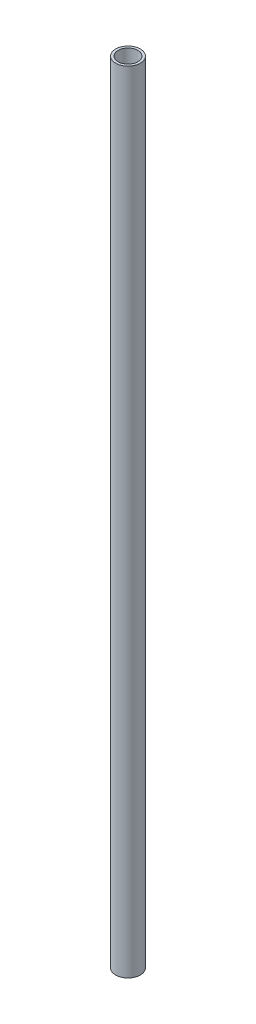
ISO-10303-21;
HEADER;
FILE_DESCRIPTION(('STEP AP214'),'2;1');
FILE_NAME('part.step','',(''),(''),'','','');
FILE_SCHEMA(('AUTOMOTIVE_DESIGN { 1 0 10303 214 1 1 1 1 }'));
ENDSEC;
DATA;
#1=APPLICATION_CONTEXT('core data for automotive mechanical design processes');
#2=APPLICATION_PROTOCOL_DEFINITION('international standard','automotive_design',2000,#1);
#3=PRODUCT_CONTEXT('',#1,'mechanical');
#4=PRODUCT('Part','Part','',(#3));
#5=PRODUCT_RELATED_PRODUCT_CATEGORY('part','',(#4));
#6=PRODUCT_DEFINITION_FORMATION('','',#4);
#7=PRODUCT_DEFINITION_CONTEXT('part definition',#1,'design');
#8=PRODUCT_DEFINITION('design','',#6,#7);
#9=PRODUCT_DEFINITION_SHAPE('','',#8);
#10=(LENGTH_UNIT() NAMED_UNIT(*) SI_UNIT(.MILLI.,.METRE.));
#11=(NAMED_UNIT(*) PLANE_ANGLE_UNIT() SI_UNIT($,.RADIAN.));
#12=(NAMED_UNIT(*) SI_UNIT($,.STERADIAN.) SOLID_ANGLE_UNIT());
#13=UNCERTAINTY_MEASURE_WITH_UNIT(LENGTH_MEASURE(1.E-05),#10,'distance_accuracy_value','');
#14=(GEOMETRIC_REPRESENTATION_CONTEXT(3) GLOBAL_UNCERTAINTY_ASSIGNED_CONTEXT((#13)) GLOBAL_UNIT_ASSIGNED_CONTEXT((#10,
#11,#12)) REPRESENTATION_CONTEXT('',''));
#15=CARTESIAN_POINT('',(0.,0.,0.));
#16=DIRECTION('',(0.,0.,1.));
#17=DIRECTION('',(1.,0.,0.));
#18=AXIS2_PLACEMENT_3D('',#15,#16,#17);
#19=CARTESIAN_POINT('',(0.,304.8,0.));
#20=DIRECTION('',(0.,1.,0.));
#21=DIRECTION('',(0.,0.,1.));
#22=AXIS2_PLACEMENT_3D('',#19,#20,#21);
#23=PLANE('',#22);
#24=CARTESIAN_POINT('',(0.,304.8,0.));
#25=DIRECTION('',(0.,1.,0.));
#26=DIRECTION('',(0.,0.,1.));
#27=AXIS2_PLACEMENT_3D('',#24,#25,#26);
#28=CIRCLE('',#27,4.7625);
#29=CARTESIAN_POINT('',(0.,304.8,4.7625));
#30=VERTEX_POINT('',#29);
#31=EDGE_CURVE('E10',#30,#30,#28,.T.);
#32=ORIENTED_EDGE('',*,*,#31,.T.);
#33=EDGE_LOOP('',(#32));
#34=FACE_BOUND('',#33,.T.);
#35=CARTESIAN_POINT('',(0.,304.8,0.));
#36=DIRECTION('',(0.,1.,0.));
#37=DIRECTION('',(0.,0.,1.));
#38=AXIS2_PLACEMENT_3D('',#35,#36,#37);
#39=CIRCLE('',#38,3.81);
#40=CARTESIAN_POINT('',(0.,304.8,3.81));
#41=VERTEX_POINT('',#40);
#42=EDGE_CURVE('E42',#41,#41,#39,.T.);
#43=ORIENTED_EDGE('',*,*,#42,.F.);
#44=EDGE_LOOP('',(#43));
#45=FACE_BOUND('',#44,.T.);
#46=ADVANCED_FACE('F31',(#34,#45),#23,.T.);
#47=CARTESIAN_POINT('',(0.,0.,0.));
#48=DIRECTION('',(0.,1.,0.));
#49=DIRECTION('',(0.,0.,1.));
#50=AXIS2_PLACEMENT_3D('',#47,#48,#49);
#51=PLANE('',#50);
#52=CARTESIAN_POINT('',(0.,0.,0.));
#53=DIRECTION('',(0.,1.,0.));
#54=DIRECTION('',(0.,0.,1.));
#55=AXIS2_PLACEMENT_3D('',#52,#53,#54);
#56=CIRCLE('',#55,4.7625);
#57=CARTESIAN_POINT('',(0.,0.,4.7625));
#58=VERTEX_POINT('',#57);
#59=EDGE_CURVE('E35',#58,#58,#56,.T.);
#60=ORIENTED_EDGE('',*,*,#59,.F.);
#61=EDGE_LOOP('',(#60));
#62=FACE_BOUND('',#61,.T.);
#63=CARTESIAN_POINT('',(0.,0.,0.));
#64=DIRECTION('',(0.,1.,0.));
#65=DIRECTION('',(0.,0.,1.));
#66=AXIS2_PLACEMENT_3D('',#63,#64,#65);
#67=CIRCLE('',#66,3.81);
#68=CARTESIAN_POINT('',(0.,0.,3.81));
#69=VERTEX_POINT('',#68);
#70=EDGE_CURVE('E44',#69,#69,#67,.T.);
#71=ORIENTED_EDGE('',*,*,#70,.T.);
#72=EDGE_LOOP('',(#71));
#73=FACE_BOUND('',#72,.T.);
#74=ADVANCED_FACE('F54',(#62,#73),#51,.F.);
#75=CARTESIAN_POINT('',(0.,304.8,0.));
#76=DIRECTION('',(0.,-1.,0.));
#77=DIRECTION('',(0.,0.,-1.));
#78=AXIS2_PLACEMENT_3D('',#75,#76,#77);
#79=CYLINDRICAL_SURFACE('',#78,4.7625);
#80=ORIENTED_EDGE('',*,*,#31,.F.);
#81=EDGE_LOOP('',(#80));
#82=FACE_BOUND('',#81,.T.);
#83=ORIENTED_EDGE('',*,*,#59,.T.);
#84=EDGE_LOOP('',(#83));
#85=FACE_BOUND('',#84,.T.);
#86=ADVANCED_FACE('F33',(#82,#85),#79,.T.);
#87=CARTESIAN_POINT('',(0.,304.8,0.));
#88=DIRECTION('',(0.,-1.,0.));
#89=DIRECTION('',(0.,0.,-1.));
#90=AXIS2_PLACEMENT_3D('',#87,#88,#89);
#91=CYLINDRICAL_SURFACE('',#90,3.81);
#92=ORIENTED_EDGE('',*,*,#42,.T.);
#93=EDGE_LOOP('',(#92));
#94=FACE_BOUND('',#93,.T.);
#95=ORIENTED_EDGE('',*,*,#70,.F.);
#96=EDGE_LOOP('',(#95));
#97=FACE_BOUND('',#96,.T.);
#98=ADVANCED_FACE('F50',(#94,#97),#91,.F.);
#99=CLOSED_SHELL('',(#46,#74,#86,#98));
#100=MANIFOLD_SOLID_BREP('B2',#99);
#101=ADVANCED_BREP_SHAPE_REPRESENTATION('',(#18,#100),#14);
#102=SHAPE_DEFINITION_REPRESENTATION(#9,#101);
ENDSEC;
END-ISO-10303-21;
